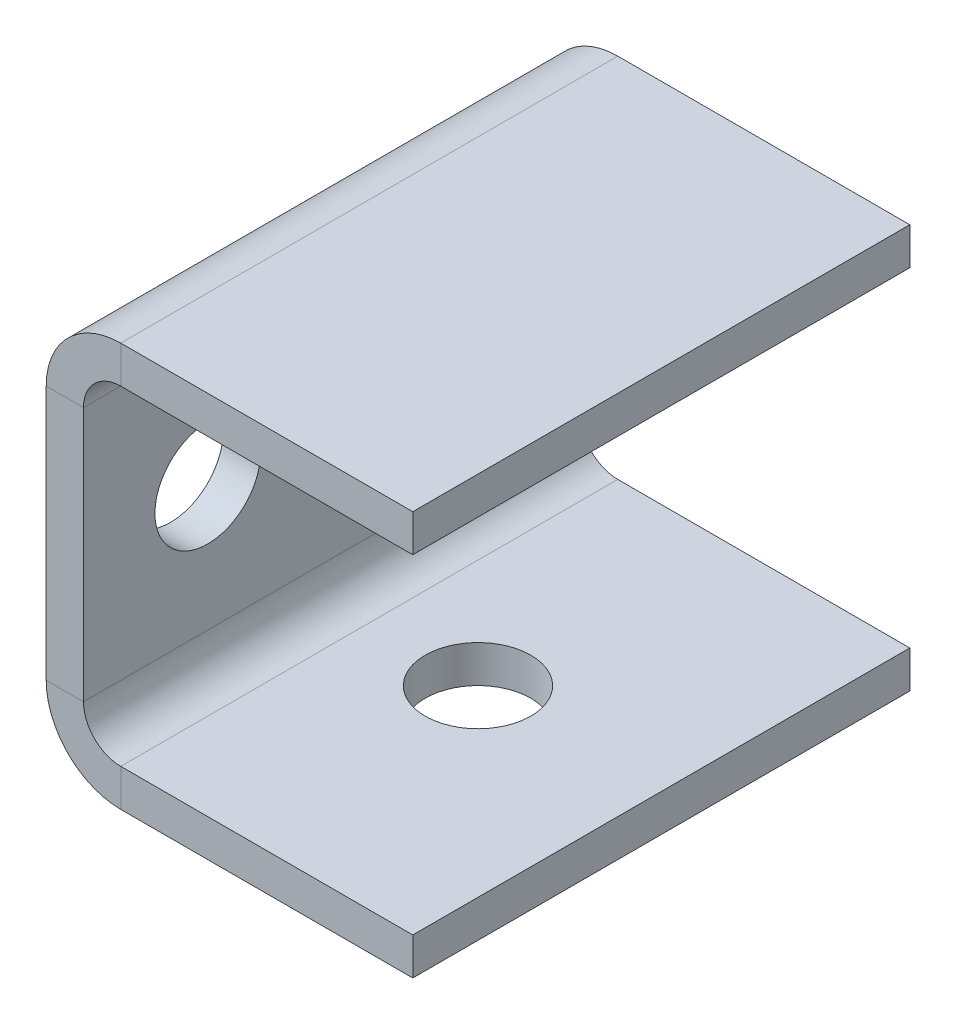
ISO-10303-21;
HEADER;
FILE_DESCRIPTION(('STEP AP214'),'2;1');
FILE_NAME('part.step','',(''),(''),'','','');
FILE_SCHEMA(('AUTOMOTIVE_DESIGN { 1 0 10303 214 1 1 1 1 }'));
ENDSEC;
DATA;
#1=APPLICATION_CONTEXT('core data for automotive mechanical design processes');
#2=APPLICATION_PROTOCOL_DEFINITION('international standard','automotive_design',2000,#1);
#3=PRODUCT_CONTEXT('',#1,'mechanical');
#4=PRODUCT('Part','Part','',(#3));
#5=PRODUCT_RELATED_PRODUCT_CATEGORY('part','',(#4));
#6=PRODUCT_DEFINITION_FORMATION('','',#4);
#7=PRODUCT_DEFINITION_CONTEXT('part definition',#1,'design');
#8=PRODUCT_DEFINITION('design','',#6,#7);
#9=PRODUCT_DEFINITION_SHAPE('','',#8);
#10=(LENGTH_UNIT() NAMED_UNIT(*) SI_UNIT(.MILLI.,.METRE.));
#11=(NAMED_UNIT(*) PLANE_ANGLE_UNIT() SI_UNIT($,.RADIAN.));
#12=(NAMED_UNIT(*) SI_UNIT($,.STERADIAN.) SOLID_ANGLE_UNIT());
#13=UNCERTAINTY_MEASURE_WITH_UNIT(LENGTH_MEASURE(1.E-05),#10,'distance_accuracy_value','');
#14=(GEOMETRIC_REPRESENTATION_CONTEXT(3) GLOBAL_UNCERTAINTY_ASSIGNED_CONTEXT((#13)) GLOBAL_UNIT_ASSIGNED_CONTEXT((#10,
#11,#12)) REPRESENTATION_CONTEXT('',''));
#15=CARTESIAN_POINT('',(0.,0.,0.));
#16=DIRECTION('',(0.,0.,1.));
#17=DIRECTION('',(1.,0.,0.));
#18=AXIS2_PLACEMENT_3D('',#15,#16,#17);
#19=CARTESIAN_POINT('',(6.00000000000001,-26.5,80.));
#20=DIRECTION('',(0.,0.,1.));
#21=DIRECTION('',(1.,0.,0.));
#22=AXIS2_PLACEMENT_3D('',#19,#20,#21);
#23=PLANE('',#22);
#24=DIRECTION('',(0.,-1.,0.));
#25=VECTOR('',#24,1.);
#26=CARTESIAN_POINT('',(6.00000000000001,-26.5,80.));
#27=LINE('',#26,#25);
#28=CARTESIAN_POINT('',(6.00000000000001,-26.5,80.));
#29=VERTEX_POINT('',#28);
#30=CARTESIAN_POINT('',(6.,-32.5,80.));
#31=VERTEX_POINT('',#30);
#32=EDGE_CURVE('E11',#29,#31,#27,.T.);
#33=ORIENTED_EDGE('',*,*,#32,.F.);
#34=CARTESIAN_POINT('',(6.00000000000001,-20.5,80.));
#35=DIRECTION('',(0.,0.,1.));
#36=DIRECTION('',(1.,0.,0.));
#37=AXIS2_PLACEMENT_3D('',#34,#35,#36);
#38=CIRCLE('',#37,6.);
#39=CARTESIAN_POINT('',(0.,-20.5,80.));
#40=VERTEX_POINT('',#39);
#41=EDGE_CURVE('E151',#29,#40,#38,.F.);
#42=ORIENTED_EDGE('',*,*,#41,.T.);
#43=DIRECTION('',(1.,0.,0.));
#44=VECTOR('',#43,1.);
#45=CARTESIAN_POINT('',(-5.99999999999999,-20.5,80.));
#46=LINE('',#45,#44);
#47=CARTESIAN_POINT('',(-5.99999999999999,-20.5,80.));
#48=VERTEX_POINT('',#47);
#49=EDGE_CURVE('E47',#48,#40,#46,.T.);
#50=ORIENTED_EDGE('',*,*,#49,.F.);
#51=CARTESIAN_POINT('',(6.00000000000001,-20.5,80.));
#52=DIRECTION('',(0.,0.,1.));
#53=DIRECTION('',(1.,0.,0.));
#54=AXIS2_PLACEMENT_3D('',#51,#52,#53);
#55=CIRCLE('',#54,12.);
#56=EDGE_CURVE('E263',#31,#48,#55,.F.);
#57=ORIENTED_EDGE('',*,*,#56,.F.);
#58=EDGE_LOOP('',(#33,#42,#50,#57));
#59=FACE_BOUND('',#58,.T.);
#60=ADVANCED_FACE('F38',(#59),#23,.T.);
#61=CARTESIAN_POINT('',(-5.99999999999999,-20.5,80.));
#62=DIRECTION('',(0.,0.,1.));
#63=DIRECTION('',(1.,0.,0.));
#64=AXIS2_PLACEMENT_3D('',#61,#62,#63);
#65=PLANE('',#64);
#66=DIRECTION('',(-1.,0.,0.));
#67=VECTOR('',#66,1.);
#68=CARTESIAN_POINT('',(0.,-26.5,80.));
#69=LINE('',#68,#67);
#70=CARTESIAN_POINT('',(53.,-26.5,80.));
#71=VERTEX_POINT('',#70);
#72=EDGE_CURVE('E156',#71,#29,#69,.T.);
#73=ORIENTED_EDGE('',*,*,#72,.T.);
#74=ORIENTED_EDGE('',*,*,#32,.T.);
#75=DIRECTION('',(1.,0.,0.));
#76=VECTOR('',#75,1.);
#77=CARTESIAN_POINT('',(0.,-32.5,80.));
#78=LINE('',#77,#76);
#79=CARTESIAN_POINT('',(53.,-32.5,80.));
#80=VERTEX_POINT('',#79);
#81=EDGE_CURVE('E265',#80,#31,#78,.F.);
#82=ORIENTED_EDGE('',*,*,#81,.F.);
#83=DIRECTION('',(0.,-1.,0.));
#84=VECTOR('',#83,1.);
#85=CARTESIAN_POINT('',(53.,-26.5,80.));
#86=LINE('',#85,#84);
#87=EDGE_CURVE('E268',#71,#80,#86,.T.);
#88=ORIENTED_EDGE('',*,*,#87,.F.);
#89=EDGE_LOOP('',(#73,#74,#82,#88));
#90=FACE_BOUND('',#89,.T.);
#91=ADVANCED_FACE('F274',(#90),#65,.T.);
#92=CARTESIAN_POINT('',(0.,-20.5,0.));
#93=DIRECTION('',(0.,0.,-1.));
#94=DIRECTION('',(-1.,0.,0.));
#95=AXIS2_PLACEMENT_3D('',#92,#93,#94);
#96=PLANE('',#95);
#97=DIRECTION('',(-1.,0.,0.));
#98=VECTOR('',#97,1.);
#99=CARTESIAN_POINT('',(0.,-20.5,0.));
#100=LINE('',#99,#98);
#101=CARTESIAN_POINT('',(0.,-20.5,0.));
#102=VERTEX_POINT('',#101);
#103=CARTESIAN_POINT('',(-5.99999999999999,-20.5,0.));
#104=VERTEX_POINT('',#103);
#105=EDGE_CURVE('E148',#102,#104,#100,.T.);
#106=ORIENTED_EDGE('',*,*,#105,.F.);
#107=CARTESIAN_POINT('',(6.00000000000001,-20.5,0.));
#108=DIRECTION('',(0.,0.,1.));
#109=DIRECTION('',(1.,0.,0.));
#110=AXIS2_PLACEMENT_3D('',#107,#108,#109);
#111=CIRCLE('',#110,6.);
#112=CARTESIAN_POINT('',(6.00000000000001,-26.5,0.));
#113=VERTEX_POINT('',#112);
#114=EDGE_CURVE('E163',#113,#102,#111,.F.);
#115=ORIENTED_EDGE('',*,*,#114,.F.);
#116=DIRECTION('',(0.,1.,0.));
#117=VECTOR('',#116,1.);
#118=CARTESIAN_POINT('',(6.,-32.5,0.));
#119=LINE('',#118,#117);
#120=CARTESIAN_POINT('',(6.,-32.5,0.));
#121=VERTEX_POINT('',#120);
#122=EDGE_CURVE('E237',#121,#113,#119,.T.);
#123=ORIENTED_EDGE('',*,*,#122,.F.);
#124=CARTESIAN_POINT('',(6.00000000000001,-20.5,0.));
#125=DIRECTION('',(0.,0.,1.));
#126=DIRECTION('',(1.,0.,0.));
#127=AXIS2_PLACEMENT_3D('',#124,#125,#126);
#128=CIRCLE('',#127,12.);
#129=EDGE_CURVE('E191',#121,#104,#128,.F.);
#130=ORIENTED_EDGE('',*,*,#129,.T.);
#131=EDGE_LOOP('',(#106,#115,#123,#130));
#132=FACE_BOUND('',#131,.T.);
#133=ADVANCED_FACE('F281',(#132),#96,.T.);
#134=CARTESIAN_POINT('',(6.,-32.5,0.));
#135=DIRECTION('',(0.,0.,-1.));
#136=DIRECTION('',(-1.,0.,0.));
#137=AXIS2_PLACEMENT_3D('',#134,#135,#136);
#138=PLANE('',#137);
#139=DIRECTION('',(0.,1.,0.));
#140=VECTOR('',#139,1.);
#141=CARTESIAN_POINT('',(0.,26.5,0.));
#142=LINE('',#141,#140);
#143=CARTESIAN_POINT('',(0.,20.5,0.));
#144=VERTEX_POINT('',#143);
#145=EDGE_CURVE('E204',#102,#144,#142,.T.);
#146=ORIENTED_EDGE('',*,*,#145,.F.);
#147=ORIENTED_EDGE('',*,*,#105,.T.);
#148=DIRECTION('',(0.,1.,0.));
#149=VECTOR('',#148,1.);
#150=CARTESIAN_POINT('',(-5.99999999999999,26.5,0.));
#151=LINE('',#150,#149);
#152=CARTESIAN_POINT('',(-5.99999999999999,20.5,0.));
#153=VERTEX_POINT('',#152);
#154=EDGE_CURVE('E189',#104,#153,#151,.T.);
#155=ORIENTED_EDGE('',*,*,#154,.T.);
#156=DIRECTION('',(1.,0.,0.));
#157=VECTOR('',#156,1.);
#158=CARTESIAN_POINT('',(-5.99999999999999,20.5,0.));
#159=LINE('',#158,#157);
#160=EDGE_CURVE('E97',#153,#144,#159,.T.);
#161=ORIENTED_EDGE('',*,*,#160,.T.);
#162=EDGE_LOOP('',(#146,#147,#155,#161));
#163=FACE_BOUND('',#162,.T.);
#164=ADVANCED_FACE('F283',(#163),#138,.T.);
#165=CARTESIAN_POINT('',(0.,20.5,80.));
#166=DIRECTION('',(0.,0.,1.));
#167=DIRECTION('',(1.,0.,0.));
#168=AXIS2_PLACEMENT_3D('',#165,#166,#167);
#169=PLANE('',#168);
#170=DIRECTION('',(-1.,0.,0.));
#171=VECTOR('',#170,1.);
#172=CARTESIAN_POINT('',(0.,20.5,80.));
#173=LINE('',#172,#171);
#174=CARTESIAN_POINT('',(0.,20.5,80.));
#175=VERTEX_POINT('',#174);
#176=CARTESIAN_POINT('',(-5.99999999999999,20.5,80.));
#177=VERTEX_POINT('',#176);
#178=EDGE_CURVE('E235',#175,#177,#173,.T.);
#179=ORIENTED_EDGE('',*,*,#178,.F.);
#180=CARTESIAN_POINT('',(6.00000000000001,20.5,80.));
#181=DIRECTION('',(0.,0.,1.));
#182=DIRECTION('',(1.,0.,0.));
#183=AXIS2_PLACEMENT_3D('',#180,#181,#182);
#184=CIRCLE('',#183,6.);
#185=CARTESIAN_POINT('',(6.00000000000001,26.5,80.));
#186=VERTEX_POINT('',#185);
#187=EDGE_CURVE('E171',#175,#186,#184,.F.);
#188=ORIENTED_EDGE('',*,*,#187,.T.);
#189=DIRECTION('',(0.,-1.,0.));
#190=VECTOR('',#189,1.);
#191=CARTESIAN_POINT('',(6.00000000000001,32.5,80.));
#192=LINE('',#191,#190);
#193=CARTESIAN_POINT('',(6.00000000000001,32.5,80.));
#194=VERTEX_POINT('',#193);
#195=EDGE_CURVE('E56',#194,#186,#192,.T.);
#196=ORIENTED_EDGE('',*,*,#195,.F.);
#197=CARTESIAN_POINT('',(6.00000000000001,20.5,80.));
#198=DIRECTION('',(0.,0.,1.));
#199=DIRECTION('',(1.,0.,0.));
#200=AXIS2_PLACEMENT_3D('',#197,#198,#199);
#201=CIRCLE('',#200,12.);
#202=EDGE_CURVE('E259',#177,#194,#201,.F.);
#203=ORIENTED_EDGE('',*,*,#202,.F.);
#204=EDGE_LOOP('',(#179,#188,#196,#203));
#205=FACE_BOUND('',#204,.T.);
#206=ADVANCED_FACE('F330',(#205),#169,.T.);
#207=CARTESIAN_POINT('',(6.00000000000001,32.5,80.));
#208=DIRECTION('',(0.,0.,1.));
#209=DIRECTION('',(1.,0.,0.));
#210=AXIS2_PLACEMENT_3D('',#207,#208,#209);
#211=PLANE('',#210);
#212=DIRECTION('',(0.,1.,0.));
#213=VECTOR('',#212,1.);
#214=CARTESIAN_POINT('',(0.,26.5,80.));
#215=LINE('',#214,#213);
#216=EDGE_CURVE('E140',#40,#175,#215,.T.);
#217=ORIENTED_EDGE('',*,*,#216,.T.);
#218=ORIENTED_EDGE('',*,*,#178,.T.);
#219=DIRECTION('',(0.,1.,0.));
#220=VECTOR('',#219,1.);
#221=CARTESIAN_POINT('',(-5.99999999999999,26.5,80.));
#222=LINE('',#221,#220);
#223=EDGE_CURVE('E143',#48,#177,#222,.T.);
#224=ORIENTED_EDGE('',*,*,#223,.F.);
#225=ORIENTED_EDGE('',*,*,#49,.T.);
#226=EDGE_LOOP('',(#217,#218,#224,#225));
#227=FACE_BOUND('',#226,.T.);
#228=ADVANCED_FACE('F138',(#227),#211,.T.);
#229=CARTESIAN_POINT('',(6.00000000000001,26.5,0.));
#230=DIRECTION('',(0.,0.,-1.));
#231=DIRECTION('',(-1.,0.,0.));
#232=AXIS2_PLACEMENT_3D('',#229,#230,#231);
#233=PLANE('',#232);
#234=DIRECTION('',(0.,1.,0.));
#235=VECTOR('',#234,1.);
#236=CARTESIAN_POINT('',(6.00000000000001,26.5,0.));
#237=LINE('',#236,#235);
#238=CARTESIAN_POINT('',(6.00000000000001,26.5,0.));
#239=VERTEX_POINT('',#238);
#240=CARTESIAN_POINT('',(6.00000000000001,32.5,0.));
#241=VERTEX_POINT('',#240);
#242=EDGE_CURVE('E104',#239,#241,#237,.T.);
#243=ORIENTED_EDGE('',*,*,#242,.F.);
#244=CARTESIAN_POINT('',(6.00000000000001,20.5,0.));
#245=DIRECTION('',(0.,0.,1.));
#246=DIRECTION('',(1.,0.,0.));
#247=AXIS2_PLACEMENT_3D('',#244,#245,#246);
#248=CIRCLE('',#247,6.);
#249=EDGE_CURVE('E206',#144,#239,#248,.F.);
#250=ORIENTED_EDGE('',*,*,#249,.F.);
#251=ORIENTED_EDGE('',*,*,#160,.F.);
#252=CARTESIAN_POINT('',(6.00000000000001,20.5,0.));
#253=DIRECTION('',(0.,0.,1.));
#254=DIRECTION('',(1.,0.,0.));
#255=AXIS2_PLACEMENT_3D('',#252,#253,#254);
#256=CIRCLE('',#255,12.);
#257=EDGE_CURVE('E187',#153,#241,#256,.F.);
#258=ORIENTED_EDGE('',*,*,#257,.T.);
#259=EDGE_LOOP('',(#243,#250,#251,#258));
#260=FACE_BOUND('',#259,.T.);
#261=ADVANCED_FACE('F296',(#260),#233,.T.);
#262=CARTESIAN_POINT('',(-5.99999999999999,20.5,0.));
#263=DIRECTION('',(0.,0.,-1.));
#264=DIRECTION('',(-1.,0.,0.));
#265=AXIS2_PLACEMENT_3D('',#262,#263,#264);
#266=PLANE('',#265);
#267=DIRECTION('',(1.,0.,0.));
#268=VECTOR('',#267,1.);
#269=CARTESIAN_POINT('',(0.,26.5,0.));
#270=LINE('',#269,#268);
#271=CARTESIAN_POINT('',(53.,26.5,0.));
#272=VERTEX_POINT('',#271);
#273=EDGE_CURVE('E177',#239,#272,#270,.T.);
#274=ORIENTED_EDGE('',*,*,#273,.F.);
#275=ORIENTED_EDGE('',*,*,#242,.T.);
#276=DIRECTION('',(1.,0.,0.));
#277=VECTOR('',#276,1.);
#278=CARTESIAN_POINT('',(0.,32.5,0.));
#279=LINE('',#278,#277);
#280=CARTESIAN_POINT('',(53.,32.5,0.));
#281=VERTEX_POINT('',#280);
#282=EDGE_CURVE('E184',#241,#281,#279,.T.);
#283=ORIENTED_EDGE('',*,*,#282,.T.);
#284=DIRECTION('',(0.,-1.,0.));
#285=VECTOR('',#284,1.);
#286=CARTESIAN_POINT('',(53.,32.5,0.));
#287=LINE('',#286,#285);
#288=EDGE_CURVE('E180',#281,#272,#287,.T.);
#289=ORIENTED_EDGE('',*,*,#288,.T.);
#290=EDGE_LOOP('',(#274,#275,#283,#289));
#291=FACE_BOUND('',#290,.T.);
#292=ADVANCED_FACE('F304',(#291),#266,.T.);
#293=CARTESIAN_POINT('',(0.,26.5,80.));
#294=DIRECTION('',(0.,1.,0.));
#295=DIRECTION('',(0.,0.,1.));
#296=AXIS2_PLACEMENT_3D('',#293,#294,#295);
#297=PLANE('',#296);
#298=ORIENTED_EDGE('',*,*,#273,.T.);
#299=DIRECTION('',(0.,0.,-1.));
#300=VECTOR('',#299,1.);
#301=CARTESIAN_POINT('',(53.,26.5,80.));
#302=LINE('',#301,#300);
#303=CARTESIAN_POINT('',(53.,26.5,80.));
#304=VERTEX_POINT('',#303);
#305=EDGE_CURVE('E230',#304,#272,#302,.T.);
#306=ORIENTED_EDGE('',*,*,#305,.F.);
#307=DIRECTION('',(1.,0.,0.));
#308=VECTOR('',#307,1.);
#309=CARTESIAN_POINT('',(0.,26.5,80.));
#310=LINE('',#309,#308);
#311=EDGE_CURVE('E110',#186,#304,#310,.T.);
#312=ORIENTED_EDGE('',*,*,#311,.F.);
#313=DIRECTION('',(0.,0.,-1.));
#314=VECTOR('',#313,1.);
#315=CARTESIAN_POINT('',(6.00000000000001,26.5,80.));
#316=LINE('',#315,#314);
#317=EDGE_CURVE('E173',#186,#239,#316,.T.);
#318=ORIENTED_EDGE('',*,*,#317,.T.);
#319=EDGE_LOOP('',(#298,#306,#312,#318));
#320=FACE_BOUND('',#319,.T.);
#321=ADVANCED_FACE('F302',(#320),#297,.F.);
#322=CARTESIAN_POINT('',(53.,32.5,80.));
#323=DIRECTION('',(1.,0.,0.));
#324=DIRECTION('',(0.,0.,-1.));
#325=AXIS2_PLACEMENT_3D('',#322,#323,#324);
#326=PLANE('',#325);
#327=ORIENTED_EDGE('',*,*,#288,.F.);
#328=DIRECTION('',(0.,0.,-1.));
#329=VECTOR('',#328,1.);
#330=CARTESIAN_POINT('',(53.,32.5,80.));
#331=LINE('',#330,#329);
#332=CARTESIAN_POINT('',(53.,32.5,80.));
#333=VERTEX_POINT('',#332);
#334=EDGE_CURVE('E228',#333,#281,#331,.T.);
#335=ORIENTED_EDGE('',*,*,#334,.F.);
#336=DIRECTION('',(0.,-1.,0.));
#337=VECTOR('',#336,1.);
#338=CARTESIAN_POINT('',(53.,32.5,80.));
#339=LINE('',#338,#337);
#340=EDGE_CURVE('E253',#333,#304,#339,.T.);
#341=ORIENTED_EDGE('',*,*,#340,.T.);
#342=ORIENTED_EDGE('',*,*,#305,.T.);
#343=EDGE_LOOP('',(#327,#335,#341,#342));
#344=FACE_BOUND('',#343,.T.);
#345=ADVANCED_FACE('F307',(#344),#326,.T.);
#346=CARTESIAN_POINT('',(0.,32.5,80.));
#347=DIRECTION('',(0.,1.,0.));
#348=DIRECTION('',(0.,0.,1.));
#349=AXIS2_PLACEMENT_3D('',#346,#347,#348);
#350=PLANE('',#349);
#351=ORIENTED_EDGE('',*,*,#282,.F.);
#352=DIRECTION('',(0.,0.,-1.));
#353=VECTOR('',#352,1.);
#354=CARTESIAN_POINT('',(6.00000000000001,32.5,80.));
#355=LINE('',#354,#353);
#356=EDGE_CURVE('E225',#194,#241,#355,.T.);
#357=ORIENTED_EDGE('',*,*,#356,.F.);
#358=DIRECTION('',(1.,0.,0.));
#359=VECTOR('',#358,1.);
#360=CARTESIAN_POINT('',(0.,32.5,80.));
#361=LINE('',#360,#359);
#362=EDGE_CURVE('E256',#194,#333,#361,.T.);
#363=ORIENTED_EDGE('',*,*,#362,.T.);
#364=ORIENTED_EDGE('',*,*,#334,.T.);
#365=EDGE_LOOP('',(#351,#357,#363,#364));
#366=FACE_BOUND('',#365,.T.);
#367=ADVANCED_FACE('F310',(#366),#350,.T.);
#368=CARTESIAN_POINT('',(6.00000000000001,20.5,80.));
#369=DIRECTION('',(0.,0.,-1.));
#370=DIRECTION('',(-1.,0.,0.));
#371=AXIS2_PLACEMENT_3D('',#368,#369,#370);
#372=CYLINDRICAL_SURFACE('',#371,12.);
#373=ORIENTED_EDGE('',*,*,#257,.F.);
#374=DIRECTION('',(0.,0.,-1.));
#375=VECTOR('',#374,1.);
#376=CARTESIAN_POINT('',(-5.99999999999999,20.5,80.));
#377=LINE('',#376,#375);
#378=EDGE_CURVE('E222',#177,#153,#377,.T.);
#379=ORIENTED_EDGE('',*,*,#378,.F.);
#380=ORIENTED_EDGE('',*,*,#202,.T.);
#381=ORIENTED_EDGE('',*,*,#356,.T.);
#382=EDGE_LOOP('',(#373,#379,#380,#381));
#383=FACE_BOUND('',#382,.T.);
#384=ADVANCED_FACE('F293',(#383),#372,.T.);
#385=CARTESIAN_POINT('',(-5.99999999999999,26.5,80.));
#386=DIRECTION('',(-1.,0.,0.));
#387=DIRECTION('',(0.,0.,1.));
#388=AXIS2_PLACEMENT_3D('',#385,#386,#387);
#389=PLANE('',#388);
#390=CARTESIAN_POINT('',(-5.99999999999999,0.,60.));
#391=DIRECTION('',(-1.,0.,0.));
#392=DIRECTION('',(0.,0.,1.));
#393=AXIS2_PLACEMENT_3D('',#390,#391,#392);
#394=CIRCLE('',#393,8.50000000000001);
#395=CARTESIAN_POINT('',(-5.99999999999999,0.,68.5));
#396=VERTEX_POINT('',#395);
#397=EDGE_CURVE('E248',#396,#396,#394,.T.);
#398=ORIENTED_EDGE('',*,*,#397,.F.);
#399=EDGE_LOOP('',(#398));
#400=FACE_BOUND('',#399,.T.);
#401=CARTESIAN_POINT('',(-5.99999999999999,0.,20.));
#402=DIRECTION('',(-1.,0.,0.));
#403=DIRECTION('',(0.,0.,1.));
#404=AXIS2_PLACEMENT_3D('',#401,#402,#403);
#405=CIRCLE('',#404,8.5);
#406=CARTESIAN_POINT('',(-5.99999999999999,0.,28.5));
#407=VERTEX_POINT('',#406);
#408=EDGE_CURVE('E240',#407,#407,#405,.T.);
#409=ORIENTED_EDGE('',*,*,#408,.F.);
#410=EDGE_LOOP('',(#409));
#411=FACE_BOUND('',#410,.T.);
#412=ORIENTED_EDGE('',*,*,#154,.F.);
#413=DIRECTION('',(0.,0.,-1.));
#414=VECTOR('',#413,1.);
#415=CARTESIAN_POINT('',(-5.99999999999999,-20.5,80.));
#416=LINE('',#415,#414);
#417=EDGE_CURVE('E219',#48,#104,#416,.T.);
#418=ORIENTED_EDGE('',*,*,#417,.F.);
#419=ORIENTED_EDGE('',*,*,#223,.T.);
#420=ORIENTED_EDGE('',*,*,#378,.T.);
#421=EDGE_LOOP('',(#412,#418,#419,#420));
#422=FACE_BOUND('',#421,.T.);
#423=ADVANCED_FACE('F288',(#400,#411,#422),#389,.T.);
#424=CARTESIAN_POINT('',(6.00000000000001,-20.5,80.));
#425=DIRECTION('',(0.,0.,-1.));
#426=DIRECTION('',(-1.,0.,0.));
#427=AXIS2_PLACEMENT_3D('',#424,#425,#426);
#428=CYLINDRICAL_SURFACE('',#427,12.);
#429=ORIENTED_EDGE('',*,*,#129,.F.);
#430=DIRECTION('',(0.,0.,-1.));
#431=VECTOR('',#430,1.);
#432=CARTESIAN_POINT('',(6.,-32.5,80.));
#433=LINE('',#432,#431);
#434=EDGE_CURVE('E216',#31,#121,#433,.T.);
#435=ORIENTED_EDGE('',*,*,#434,.F.);
#436=ORIENTED_EDGE('',*,*,#56,.T.);
#437=ORIENTED_EDGE('',*,*,#417,.T.);
#438=EDGE_LOOP('',(#429,#435,#436,#437));
#439=FACE_BOUND('',#438,.T.);
#440=ADVANCED_FACE('F286',(#439),#428,.T.);
#441=CARTESIAN_POINT('',(0.,-32.5,80.));
#442=DIRECTION('',(0.,-1.,0.));
#443=DIRECTION('',(0.,0.,-1.));
#444=AXIS2_PLACEMENT_3D('',#441,#442,#443);
#445=PLANE('',#444);
#446=CARTESIAN_POINT('',(23.5,-32.5,40.));
#447=DIRECTION('',(0.,-1.,0.));
#448=DIRECTION('',(0.,0.,-1.));
#449=AXIS2_PLACEMENT_3D('',#446,#447,#448);
#450=CIRCLE('',#449,8.5);
#451=CARTESIAN_POINT('',(23.5,-32.5,31.5));
#452=VERTEX_POINT('',#451);
#453=EDGE_CURVE('E578',#452,#452,#450,.T.);
#454=ORIENTED_EDGE('',*,*,#453,.F.);
#455=EDGE_LOOP('',(#454));
#456=FACE_BOUND('',#455,.T.);
#457=DIRECTION('',(1.,0.,0.));
#458=VECTOR('',#457,1.);
#459=CARTESIAN_POINT('',(0.,-32.5,0.));
#460=LINE('',#459,#458);
#461=CARTESIAN_POINT('',(53.,-32.5,0.));
#462=VERTEX_POINT('',#461);
#463=EDGE_CURVE('E194',#462,#121,#460,.F.);
#464=ORIENTED_EDGE('',*,*,#463,.F.);
#465=DIRECTION('',(0.,0.,-1.));
#466=VECTOR('',#465,1.);
#467=CARTESIAN_POINT('',(53.,-32.5,80.));
#468=LINE('',#467,#466);
#469=EDGE_CURVE('E214',#80,#462,#468,.T.);
#470=ORIENTED_EDGE('',*,*,#469,.F.);
#471=ORIENTED_EDGE('',*,*,#81,.T.);
#472=ORIENTED_EDGE('',*,*,#434,.T.);
#473=EDGE_LOOP('',(#464,#470,#471,#472));
#474=FACE_BOUND('',#473,.T.);
#475=ADVANCED_FACE('F373',(#456,#474),#445,.T.);
#476=CARTESIAN_POINT('',(53.,-26.5,80.));
#477=DIRECTION('',(1.,0.,0.));
#478=DIRECTION('',(0.,0.,-1.));
#479=AXIS2_PLACEMENT_3D('',#476,#477,#478);
#480=PLANE('',#479);
#481=DIRECTION('',(0.,-1.,0.));
#482=VECTOR('',#481,1.);
#483=CARTESIAN_POINT('',(53.,-26.5,0.));
#484=LINE('',#483,#482);
#485=CARTESIAN_POINT('',(53.,-26.5,0.));
#486=VERTEX_POINT('',#485);
#487=EDGE_CURVE('E197',#486,#462,#484,.T.);
#488=ORIENTED_EDGE('',*,*,#487,.F.);
#489=DIRECTION('',(0.,0.,-1.));
#490=VECTOR('',#489,1.);
#491=CARTESIAN_POINT('',(53.,-26.5,80.));
#492=LINE('',#491,#490);
#493=EDGE_CURVE('E212',#71,#486,#492,.T.);
#494=ORIENTED_EDGE('',*,*,#493,.F.);
#495=ORIENTED_EDGE('',*,*,#87,.T.);
#496=ORIENTED_EDGE('',*,*,#469,.T.);
#497=EDGE_LOOP('',(#488,#494,#495,#496));
#498=FACE_BOUND('',#497,.T.);
#499=ADVANCED_FACE('F381',(#498),#480,.T.);
#500=CARTESIAN_POINT('',(0.,-26.5,80.));
#501=DIRECTION('',(0.,-1.,0.));
#502=DIRECTION('',(0.,0.,-1.));
#503=AXIS2_PLACEMENT_3D('',#500,#501,#502);
#504=PLANE('',#503);
#505=CARTESIAN_POINT('',(23.5,-26.5,40.));
#506=DIRECTION('',(0.,-1.,0.));
#507=DIRECTION('',(0.,0.,-1.));
#508=AXIS2_PLACEMENT_3D('',#505,#506,#507);
#509=CIRCLE('',#508,8.5);
#510=CARTESIAN_POINT('',(23.5,-26.5,31.5));
#511=VERTEX_POINT('',#510);
#512=EDGE_CURVE('E581',#511,#511,#509,.F.);
#513=ORIENTED_EDGE('',*,*,#512,.F.);
#514=EDGE_LOOP('',(#513));
#515=FACE_BOUND('',#514,.T.);
#516=DIRECTION('',(-1.,0.,0.));
#517=VECTOR('',#516,1.);
#518=CARTESIAN_POINT('',(0.,-26.5,0.));
#519=LINE('',#518,#517);
#520=EDGE_CURVE('E200',#486,#113,#519,.T.);
#521=ORIENTED_EDGE('',*,*,#520,.T.);
#522=DIRECTION('',(0.,0.,-1.));
#523=VECTOR('',#522,1.);
#524=CARTESIAN_POINT('',(6.00000000000001,-26.5,80.));
#525=LINE('',#524,#523);
#526=EDGE_CURVE('E165',#29,#113,#525,.T.);
#527=ORIENTED_EDGE('',*,*,#526,.F.);
#528=ORIENTED_EDGE('',*,*,#72,.F.);
#529=ORIENTED_EDGE('',*,*,#493,.T.);
#530=EDGE_LOOP('',(#521,#527,#528,#529));
#531=FACE_BOUND('',#530,.T.);
#532=ADVANCED_FACE('F278',(#515,#531),#504,.F.);
#533=CARTESIAN_POINT('',(6.00000000000001,-20.5,80.));
#534=DIRECTION('',(0.,0.,-1.));
#535=DIRECTION('',(-1.,0.,0.));
#536=AXIS2_PLACEMENT_3D('',#533,#534,#535);
#537=CYLINDRICAL_SURFACE('',#536,6.);
#538=ORIENTED_EDGE('',*,*,#114,.T.);
#539=DIRECTION('',(0.,0.,-1.));
#540=VECTOR('',#539,1.);
#541=CARTESIAN_POINT('',(0.,-20.5,80.));
#542=LINE('',#541,#540);
#543=EDGE_CURVE('E160',#40,#102,#542,.T.);
#544=ORIENTED_EDGE('',*,*,#543,.F.);
#545=ORIENTED_EDGE('',*,*,#41,.F.);
#546=ORIENTED_EDGE('',*,*,#526,.T.);
#547=EDGE_LOOP('',(#538,#544,#545,#546));
#548=FACE_BOUND('',#547,.T.);
#549=ADVANCED_FACE('F161',(#548),#537,.F.);
#550=CARTESIAN_POINT('',(0.,26.5,80.));
#551=DIRECTION('',(-1.,0.,0.));
#552=DIRECTION('',(0.,0.,1.));
#553=AXIS2_PLACEMENT_3D('',#550,#551,#552);
#554=PLANE('',#553);
#555=CARTESIAN_POINT('',(0.,0.,60.));
#556=DIRECTION('',(-1.,0.,0.));
#557=DIRECTION('',(0.,0.,1.));
#558=AXIS2_PLACEMENT_3D('',#555,#556,#557);
#559=CIRCLE('',#558,8.50000000000001);
#560=CARTESIAN_POINT('',(0.,0.,68.5));
#561=VERTEX_POINT('',#560);
#562=EDGE_CURVE('E41',#561,#561,#559,.T.);
#563=ORIENTED_EDGE('',*,*,#562,.T.);
#564=EDGE_LOOP('',(#563));
#565=FACE_BOUND('',#564,.T.);
#566=CARTESIAN_POINT('',(0.,0.,20.));
#567=DIRECTION('',(-1.,0.,0.));
#568=DIRECTION('',(0.,0.,1.));
#569=AXIS2_PLACEMENT_3D('',#566,#567,#568);
#570=CIRCLE('',#569,8.5);
#571=CARTESIAN_POINT('',(0.,0.,28.5));
#572=VERTEX_POINT('',#571);
#573=EDGE_CURVE('E181',#572,#572,#570,.T.);
#574=ORIENTED_EDGE('',*,*,#573,.T.);
#575=EDGE_LOOP('',(#574));
#576=FACE_BOUND('',#575,.T.);
#577=ORIENTED_EDGE('',*,*,#145,.T.);
#578=DIRECTION('',(0.,0.,-1.));
#579=VECTOR('',#578,1.);
#580=CARTESIAN_POINT('',(0.,20.5,80.));
#581=LINE('',#580,#579);
#582=EDGE_CURVE('E166',#175,#144,#581,.T.);
#583=ORIENTED_EDGE('',*,*,#582,.F.);
#584=ORIENTED_EDGE('',*,*,#216,.F.);
#585=ORIENTED_EDGE('',*,*,#543,.T.);
#586=EDGE_LOOP('',(#577,#583,#584,#585));
#587=FACE_BOUND('',#586,.T.);
#588=ADVANCED_FACE('F168',(#565,#576,#587),#554,.F.);
#589=CARTESIAN_POINT('',(6.00000000000001,20.5,80.));
#590=DIRECTION('',(0.,0.,-1.));
#591=DIRECTION('',(-1.,0.,0.));
#592=AXIS2_PLACEMENT_3D('',#589,#590,#591);
#593=CYLINDRICAL_SURFACE('',#592,6.);
#594=ORIENTED_EDGE('',*,*,#249,.T.);
#595=ORIENTED_EDGE('',*,*,#317,.F.);
#596=ORIENTED_EDGE('',*,*,#187,.F.);
#597=ORIENTED_EDGE('',*,*,#582,.T.);
#598=EDGE_LOOP('',(#594,#595,#596,#597));
#599=FACE_BOUND('',#598,.T.);
#600=ADVANCED_FACE('F299',(#599),#593,.F.);
#601=CARTESIAN_POINT('',(6.00000000000001,20.5,80.));
#602=DIRECTION('',(0.,0.,1.));
#603=DIRECTION('',(1.,0.,0.));
#604=AXIS2_PLACEMENT_3D('',#601,#602,#603);
#605=PLANE('',#604);
#606=ORIENTED_EDGE('',*,*,#311,.T.);
#607=ORIENTED_EDGE('',*,*,#340,.F.);
#608=ORIENTED_EDGE('',*,*,#362,.F.);
#609=ORIENTED_EDGE('',*,*,#195,.T.);
#610=EDGE_LOOP('',(#606,#607,#608,#609));
#611=FACE_BOUND('',#610,.T.);
#612=ADVANCED_FACE('F308',(#611),#605,.T.);
#613=CARTESIAN_POINT('',(6.00000000000001,20.5,0.));
#614=DIRECTION('',(0.,0.,1.));
#615=DIRECTION('',(1.,0.,0.));
#616=AXIS2_PLACEMENT_3D('',#613,#614,#615);
#617=PLANE('',#616);
#618=ORIENTED_EDGE('',*,*,#463,.T.);
#619=ORIENTED_EDGE('',*,*,#122,.T.);
#620=ORIENTED_EDGE('',*,*,#520,.F.);
#621=ORIENTED_EDGE('',*,*,#487,.T.);
#622=EDGE_LOOP('',(#618,#619,#620,#621));
#623=FACE_BOUND('',#622,.T.);
#624=ADVANCED_FACE('F418',(#623),#617,.F.);
#625=CARTESIAN_POINT('',(53.,0.,20.));
#626=DIRECTION('',(-1.,0.,0.));
#627=DIRECTION('',(0.,0.,1.));
#628=AXIS2_PLACEMENT_3D('',#625,#626,#627);
#629=CYLINDRICAL_SURFACE('',#628,8.5);
#630=ORIENTED_EDGE('',*,*,#408,.T.);
#631=EDGE_LOOP('',(#630));
#632=FACE_BOUND('',#631,.T.);
#633=ORIENTED_EDGE('',*,*,#573,.F.);
#634=EDGE_LOOP('',(#633));
#635=FACE_BOUND('',#634,.T.);
#636=ADVANCED_FACE('F428',(#632,#635),#629,.F.);
#637=CARTESIAN_POINT('',(53.,0.,60.));
#638=DIRECTION('',(-1.,0.,0.));
#639=DIRECTION('',(0.,0.,1.));
#640=AXIS2_PLACEMENT_3D('',#637,#638,#639);
#641=CYLINDRICAL_SURFACE('',#640,8.50000000000001);
#642=ORIENTED_EDGE('',*,*,#397,.T.);
#643=EDGE_LOOP('',(#642));
#644=FACE_BOUND('',#643,.T.);
#645=ORIENTED_EDGE('',*,*,#562,.F.);
#646=EDGE_LOOP('',(#645));
#647=FACE_BOUND('',#646,.T.);
#648=ADVANCED_FACE('F455',(#644,#647),#641,.F.);
#649=CARTESIAN_POINT('',(23.5,32.501,40.));
#650=DIRECTION('',(0.,-1.,0.));
#651=DIRECTION('',(0.,0.,-1.));
#652=AXIS2_PLACEMENT_3D('',#649,#650,#651);
#653=CYLINDRICAL_SURFACE('',#652,8.5);
#654=ORIENTED_EDGE('',*,*,#453,.T.);
#655=EDGE_LOOP('',(#654));
#656=FACE_BOUND('',#655,.T.);
#657=ORIENTED_EDGE('',*,*,#512,.T.);
#658=EDGE_LOOP('',(#657));
#659=FACE_BOUND('',#658,.T.);
#660=ADVANCED_FACE('F465',(#656,#659),#653,.F.);
#661=CLOSED_SHELL('',(#60,#91,#133,#164,#206,#228,#261,#292,#321,#345,#367,#384,#423,#440,#475,
#499,#532,#549,#588,#600,#612,#624,#636,#648,#660));
#662=MANIFOLD_SOLID_BREP('B2',#661);
#663=ADVANCED_BREP_SHAPE_REPRESENTATION('',(#18,#662),#14);
#664=SHAPE_DEFINITION_REPRESENTATION(#9,#663);
ENDSEC;
END-ISO-10303-21;
